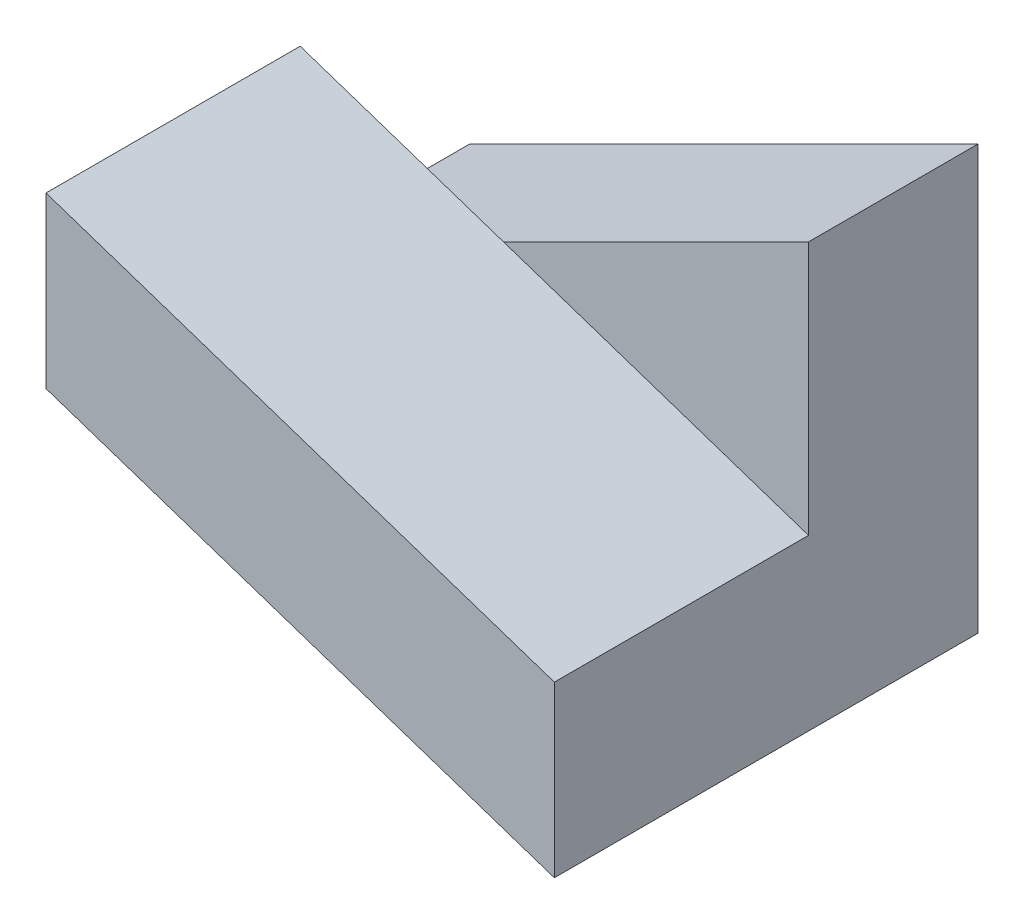
ISO-10303-21;
HEADER;
FILE_DESCRIPTION(('STEP AP214'),'2;1');
FILE_NAME('part.step','',(''),(''),'','','');
FILE_SCHEMA(('AUTOMOTIVE_DESIGN { 1 0 10303 214 1 1 1 1 }'));
ENDSEC;
DATA;
#1=APPLICATION_CONTEXT('core data for automotive mechanical design processes');
#2=APPLICATION_PROTOCOL_DEFINITION('international standard','automotive_design',2000,#1);
#3=PRODUCT_CONTEXT('',#1,'mechanical');
#4=PRODUCT('Part','Part','',(#3));
#5=PRODUCT_RELATED_PRODUCT_CATEGORY('part','',(#4));
#6=PRODUCT_DEFINITION_FORMATION('','',#4);
#7=PRODUCT_DEFINITION_CONTEXT('part definition',#1,'design');
#8=PRODUCT_DEFINITION('design','',#6,#7);
#9=PRODUCT_DEFINITION_SHAPE('','',#8);
#10=(LENGTH_UNIT() NAMED_UNIT(*) SI_UNIT(.MILLI.,.METRE.));
#11=(NAMED_UNIT(*) PLANE_ANGLE_UNIT() SI_UNIT($,.RADIAN.));
#12=(NAMED_UNIT(*) SI_UNIT($,.STERADIAN.) SOLID_ANGLE_UNIT());
#13=UNCERTAINTY_MEASURE_WITH_UNIT(LENGTH_MEASURE(1.E-05),#10,'distance_accuracy_value','');
#14=(GEOMETRIC_REPRESENTATION_CONTEXT(3) GLOBAL_UNCERTAINTY_ASSIGNED_CONTEXT((#13)) GLOBAL_UNIT_ASSIGNED_CONTEXT((#10,
#11,#12)) REPRESENTATION_CONTEXT('',''));
#15=CARTESIAN_POINT('',(0.,0.,0.));
#16=DIRECTION('',(0.,0.,1.));
#17=DIRECTION('',(1.,0.,0.));
#18=AXIS2_PLACEMENT_3D('',#15,#16,#17);
#19=CARTESIAN_POINT('',(0.,0.,10.));
#20=DIRECTION('',(0.,0.,-1.));
#21=DIRECTION('',(-1.,0.,0.));
#22=AXIS2_PLACEMENT_3D('',#19,#20,#21);
#23=PLANE('',#22);
#24=DIRECTION('',(0.948683298050514,-0.316227766016838,0.));
#25=VECTOR('',#24,1.);
#26=CARTESIAN_POINT('',(-30.,10.,10.));
#27=LINE('',#26,#25);
#28=CARTESIAN_POINT('',(-30.,10.,10.));
#29=VERTEX_POINT('',#28);
#30=CARTESIAN_POINT('',(0.,0.,10.));
#31=VERTEX_POINT('',#30);
#32=EDGE_CURVE('E123',#29,#31,#27,.T.);
#33=ORIENTED_EDGE('',*,*,#32,.F.);
#34=DIRECTION('',(0.,-1.,0.));
#35=VECTOR('',#34,1.);
#36=CARTESIAN_POINT('',(-30.,0.,10.));
#37=LINE('',#36,#35);
#38=CARTESIAN_POINT('',(-30.,0.,10.));
#39=VERTEX_POINT('',#38);
#40=EDGE_CURVE('E153',#29,#39,#37,.T.);
#41=ORIENTED_EDGE('',*,*,#40,.T.);
#42=DIRECTION('',(1.,0.,0.));
#43=VECTOR('',#42,1.);
#44=CARTESIAN_POINT('',(0.,0.,10.));
#45=LINE('',#44,#43);
#46=EDGE_CURVE('E59',#39,#31,#45,.T.);
#47=ORIENTED_EDGE('',*,*,#46,.T.);
#48=EDGE_LOOP('',(#33,#41,#47));
#49=FACE_BOUND('',#48,.T.);
#50=ADVANCED_FACE('F33',(#49),#23,.F.);
#51=DIRECTION('',(-0.948683298050514,0.316227766016838,0.));
#52=VECTOR('',#51,1.);
#53=CARTESIAN_POINT('',(-30.,20.,10.));
#54=LINE('',#53,#52);
#55=CARTESIAN_POINT('',(0.,10.,10.));
#56=VERTEX_POINT('',#55);
#57=CARTESIAN_POINT('',(-18.,16.,10.));
#58=VERTEX_POINT('',#57);
#59=EDGE_CURVE('E50',#56,#58,#54,.T.);
#60=ORIENTED_EDGE('',*,*,#59,.F.);
#61=DIRECTION('',(0.,1.,0.));
#62=VECTOR('',#61,1.);
#63=CARTESIAN_POINT('',(0.,25.,10.));
#64=LINE('',#63,#62);
#65=CARTESIAN_POINT('',(0.,25.,10.));
#66=VERTEX_POINT('',#65);
#67=EDGE_CURVE('E83',#56,#66,#64,.T.);
#68=ORIENTED_EDGE('',*,*,#67,.T.);
#69=DIRECTION('',(-0.894427190999916,-0.447213595499958,0.));
#70=VECTOR('',#69,1.);
#71=CARTESIAN_POINT('',(-30.,10.,10.));
#72=LINE('',#71,#70);
#73=EDGE_CURVE('E151',#66,#58,#72,.T.);
#74=ORIENTED_EDGE('',*,*,#73,.T.);
#75=EDGE_LOOP('',(#60,#68,#74));
#76=FACE_BOUND('',#75,.T.);
#77=ADVANCED_FACE('F183',(#76),#23,.F.);
#78=CARTESIAN_POINT('',(0.,25.,10.));
#79=DIRECTION('',(-1.,0.,0.));
#80=DIRECTION('',(0.,0.,1.));
#81=AXIS2_PLACEMENT_3D('',#78,#79,#80);
#82=PLANE('',#81);
#83=DIRECTION('',(0.,1.,0.));
#84=VECTOR('',#83,1.);
#85=CARTESIAN_POINT('',(0.,25.,0.));
#86=LINE('',#85,#84);
#87=CARTESIAN_POINT('',(0.,0.,0.));
#88=VERTEX_POINT('',#87);
#89=CARTESIAN_POINT('',(0.,25.,0.));
#90=VERTEX_POINT('',#89);
#91=EDGE_CURVE('E127',#88,#90,#86,.T.);
#92=ORIENTED_EDGE('',*,*,#91,.T.);
#93=DIRECTION('',(0.,0.,-1.));
#94=VECTOR('',#93,1.);
#95=CARTESIAN_POINT('',(0.,25.,10.));
#96=LINE('',#95,#94);
#97=EDGE_CURVE('E11',#66,#90,#96,.T.);
#98=ORIENTED_EDGE('',*,*,#97,.F.);
#99=ORIENTED_EDGE('',*,*,#67,.F.);
#100=DIRECTION('',(0.,0.,-1.));
#101=VECTOR('',#100,1.);
#102=CARTESIAN_POINT('',(0.,10.,25.));
#103=LINE('',#102,#101);
#104=CARTESIAN_POINT('',(0.,10.,25.));
#105=VERTEX_POINT('',#104);
#106=EDGE_CURVE('E108',#105,#56,#103,.T.);
#107=ORIENTED_EDGE('',*,*,#106,.F.);
#108=DIRECTION('',(0.,1.,0.));
#109=VECTOR('',#108,1.);
#110=CARTESIAN_POINT('',(0.,0.,25.));
#111=LINE('',#110,#109);
#112=CARTESIAN_POINT('',(0.,0.,25.));
#113=VERTEX_POINT('',#112);
#114=EDGE_CURVE('E114',#113,#105,#111,.T.);
#115=ORIENTED_EDGE('',*,*,#114,.F.);
#116=DIRECTION('',(0.,0.,-1.));
#117=VECTOR('',#116,1.);
#118=CARTESIAN_POINT('',(0.,0.,25.));
#119=LINE('',#118,#117);
#120=EDGE_CURVE('E146',#113,#31,#119,.T.);
#121=ORIENTED_EDGE('',*,*,#120,.T.);
#122=DIRECTION('',(0.,0.,-1.));
#123=VECTOR('',#122,1.);
#124=CARTESIAN_POINT('',(0.,0.,10.));
#125=LINE('',#124,#123);
#126=EDGE_CURVE('E156',#31,#88,#125,.T.);
#127=ORIENTED_EDGE('',*,*,#126,.T.);
#128=EDGE_LOOP('',(#92,#98,#99,#107,#115,#121,#127));
#129=FACE_BOUND('',#128,.T.);
#130=ADVANCED_FACE('F35',(#129),#82,.F.);
#131=CARTESIAN_POINT('',(-30.,10.,10.));
#132=DIRECTION('',(0.447213595499958,-0.894427190999916,0.));
#133=DIRECTION('',(0.894427190999916,0.447213595499958,0.));
#134=AXIS2_PLACEMENT_3D('',#131,#132,#133);
#135=PLANE('',#134);
#136=DIRECTION('',(-0.894427190999916,-0.447213595499958,0.));
#137=VECTOR('',#136,1.);
#138=CARTESIAN_POINT('',(-30.,10.,0.));
#139=LINE('',#138,#137);
#140=CARTESIAN_POINT('',(-30.,10.,0.));
#141=VERTEX_POINT('',#140);
#142=EDGE_CURVE('E128',#90,#141,#139,.T.);
#143=ORIENTED_EDGE('',*,*,#142,.T.);
#144=DIRECTION('',(0.,0.,-1.));
#145=VECTOR('',#144,1.);
#146=CARTESIAN_POINT('',(-30.,10.,10.));
#147=LINE('',#146,#145);
#148=EDGE_CURVE('E42',#29,#141,#147,.T.);
#149=ORIENTED_EDGE('',*,*,#148,.F.);
#150=EDGE_CURVE('E154',#58,#29,#72,.T.);
#151=ORIENTED_EDGE('',*,*,#150,.F.);
#152=ORIENTED_EDGE('',*,*,#73,.F.);
#153=ORIENTED_EDGE('',*,*,#97,.T.);
#154=EDGE_LOOP('',(#143,#149,#151,#152,#153));
#155=FACE_BOUND('',#154,.T.);
#156=ADVANCED_FACE('F196',(#155),#135,.F.);
#157=CARTESIAN_POINT('',(-30.,0.,10.));
#158=DIRECTION('',(1.,0.,0.));
#159=DIRECTION('',(0.,0.,-1.));
#160=AXIS2_PLACEMENT_3D('',#157,#158,#159);
#161=PLANE('',#160);
#162=DIRECTION('',(0.,-1.,0.));
#163=VECTOR('',#162,1.);
#164=CARTESIAN_POINT('',(-30.,0.,0.));
#165=LINE('',#164,#163);
#166=CARTESIAN_POINT('',(-30.,0.,0.));
#167=VERTEX_POINT('',#166);
#168=EDGE_CURVE('E159',#141,#167,#165,.T.);
#169=ORIENTED_EDGE('',*,*,#168,.T.);
#170=DIRECTION('',(0.,0.,-1.));
#171=VECTOR('',#170,1.);
#172=CARTESIAN_POINT('',(-30.,0.,10.));
#173=LINE('',#172,#171);
#174=EDGE_CURVE('E163',#39,#167,#173,.T.);
#175=ORIENTED_EDGE('',*,*,#174,.F.);
#176=ORIENTED_EDGE('',*,*,#40,.F.);
#177=ORIENTED_EDGE('',*,*,#148,.T.);
#178=EDGE_LOOP('',(#169,#175,#176,#177));
#179=FACE_BOUND('',#178,.T.);
#180=ADVANCED_FACE('F170',(#179),#161,.F.);
#181=CARTESIAN_POINT('',(0.,0.,10.));
#182=DIRECTION('',(0.,1.,0.));
#183=DIRECTION('',(-1.,0.,0.));
#184=AXIS2_PLACEMENT_3D('',#181,#182,#183);
#185=PLANE('',#184);
#186=DIRECTION('',(1.,0.,0.));
#187=VECTOR('',#186,1.);
#188=CARTESIAN_POINT('',(0.,0.,0.));
#189=LINE('',#188,#187);
#190=EDGE_CURVE('E80',#167,#88,#189,.T.);
#191=ORIENTED_EDGE('',*,*,#190,.T.);
#192=ORIENTED_EDGE('',*,*,#126,.F.);
#193=ORIENTED_EDGE('',*,*,#46,.F.);
#194=ORIENTED_EDGE('',*,*,#174,.T.);
#195=EDGE_LOOP('',(#191,#192,#193,#194));
#196=FACE_BOUND('',#195,.T.);
#197=ADVANCED_FACE('F178',(#196),#185,.F.);
#198=CARTESIAN_POINT('',(0.,0.,0.));
#199=DIRECTION('',(0.,0.,-1.));
#200=DIRECTION('',(-1.,0.,0.));
#201=AXIS2_PLACEMENT_3D('',#198,#199,#200);
#202=PLANE('',#201);
#203=ORIENTED_EDGE('',*,*,#91,.F.);
#204=ORIENTED_EDGE('',*,*,#190,.F.);
#205=ORIENTED_EDGE('',*,*,#168,.F.);
#206=ORIENTED_EDGE('',*,*,#142,.F.);
#207=EDGE_LOOP('',(#203,#204,#205,#206));
#208=FACE_BOUND('',#207,.T.);
#209=ADVANCED_FACE('F177',(#208),#202,.T.);
#210=CARTESIAN_POINT('',(-30.,20.,25.));
#211=DIRECTION('',(-0.316227766016838,-0.948683298050514,0.));
#212=DIRECTION('',(0.948683298050514,-0.316227766016838,0.));
#213=AXIS2_PLACEMENT_3D('',#210,#211,#212);
#214=PLANE('',#213);
#215=ORIENTED_EDGE('',*,*,#59,.T.);
#216=CARTESIAN_POINT('',(-30.,20.,10.));
#217=VERTEX_POINT('',#216);
#218=EDGE_CURVE('E136',#58,#217,#54,.T.);
#219=ORIENTED_EDGE('',*,*,#218,.T.);
#220=DIRECTION('',(0.,0.,-1.));
#221=VECTOR('',#220,1.);
#222=CARTESIAN_POINT('',(-30.,20.,25.));
#223=LINE('',#222,#221);
#224=CARTESIAN_POINT('',(-30.,20.,25.));
#225=VERTEX_POINT('',#224);
#226=EDGE_CURVE('E110',#225,#217,#223,.T.);
#227=ORIENTED_EDGE('',*,*,#226,.F.);
#228=DIRECTION('',(-0.948683298050514,0.316227766016838,0.));
#229=VECTOR('',#228,1.);
#230=CARTESIAN_POINT('',(-30.,20.,25.));
#231=LINE('',#230,#229);
#232=EDGE_CURVE('E104',#105,#225,#231,.T.);
#233=ORIENTED_EDGE('',*,*,#232,.F.);
#234=ORIENTED_EDGE('',*,*,#106,.T.);
#235=EDGE_LOOP('',(#215,#219,#227,#233,#234));
#236=FACE_BOUND('',#235,.T.);
#237=ADVANCED_FACE('F106',(#236),#214,.F.);
#238=CARTESIAN_POINT('',(-30.,10.,25.));
#239=DIRECTION('',(1.,0.,0.));
#240=DIRECTION('',(0.,0.,-1.));
#241=AXIS2_PLACEMENT_3D('',#238,#239,#240);
#242=PLANE('',#241);
#243=DIRECTION('',(0.,-1.,0.));
#244=VECTOR('',#243,1.);
#245=CARTESIAN_POINT('',(-30.,10.,10.));
#246=LINE('',#245,#244);
#247=EDGE_CURVE('E135',#217,#29,#246,.T.);
#248=ORIENTED_EDGE('',*,*,#247,.T.);
#249=DIRECTION('',(0.,0.,-1.));
#250=VECTOR('',#249,1.);
#251=CARTESIAN_POINT('',(-30.,10.,25.));
#252=LINE('',#251,#250);
#253=CARTESIAN_POINT('',(-30.,10.,25.));
#254=VERTEX_POINT('',#253);
#255=EDGE_CURVE('E130',#254,#29,#252,.T.);
#256=ORIENTED_EDGE('',*,*,#255,.F.);
#257=DIRECTION('',(0.,-1.,0.));
#258=VECTOR('',#257,1.);
#259=CARTESIAN_POINT('',(-30.,10.,25.));
#260=LINE('',#259,#258);
#261=EDGE_CURVE('E113',#225,#254,#260,.T.);
#262=ORIENTED_EDGE('',*,*,#261,.F.);
#263=ORIENTED_EDGE('',*,*,#226,.T.);
#264=EDGE_LOOP('',(#248,#256,#262,#263));
#265=FACE_BOUND('',#264,.T.);
#266=ADVANCED_FACE('F206',(#265),#242,.F.);
#267=CARTESIAN_POINT('',(-30.,10.,25.));
#268=DIRECTION('',(0.316227766016838,0.948683298050514,0.));
#269=DIRECTION('',(-0.948683298050514,0.316227766016838,0.));
#270=AXIS2_PLACEMENT_3D('',#267,#268,#269);
#271=PLANE('',#270);
#272=ORIENTED_EDGE('',*,*,#32,.T.);
#273=ORIENTED_EDGE('',*,*,#120,.F.);
#274=DIRECTION('',(0.948683298050514,-0.316227766016838,0.));
#275=VECTOR('',#274,1.);
#276=CARTESIAN_POINT('',(-30.,10.,25.));
#277=LINE('',#276,#275);
#278=EDGE_CURVE('E119',#254,#113,#277,.T.);
#279=ORIENTED_EDGE('',*,*,#278,.F.);
#280=ORIENTED_EDGE('',*,*,#255,.T.);
#281=EDGE_LOOP('',(#272,#273,#279,#280));
#282=FACE_BOUND('',#281,.T.);
#283=ADVANCED_FACE('F180',(#282),#271,.F.);
#284=CARTESIAN_POINT('',(0.,0.,25.));
#285=DIRECTION('',(0.,0.,-1.));
#286=DIRECTION('',(-1.,0.,0.));
#287=AXIS2_PLACEMENT_3D('',#284,#285,#286);
#288=PLANE('',#287);
#289=ORIENTED_EDGE('',*,*,#114,.T.);
#290=ORIENTED_EDGE('',*,*,#232,.T.);
#291=ORIENTED_EDGE('',*,*,#261,.T.);
#292=ORIENTED_EDGE('',*,*,#278,.T.);
#293=EDGE_LOOP('',(#289,#290,#291,#292));
#294=FACE_BOUND('',#293,.T.);
#295=ADVANCED_FACE('F117',(#294),#288,.F.);
#296=CARTESIAN_POINT('',(0.,0.,10.));
#297=DIRECTION('',(0.,0.,-1.));
#298=DIRECTION('',(-1.,0.,0.));
#299=AXIS2_PLACEMENT_3D('',#296,#297,#298);
#300=PLANE('',#299);
#301=ORIENTED_EDGE('',*,*,#218,.F.);
#302=ORIENTED_EDGE('',*,*,#150,.T.);
#303=ORIENTED_EDGE('',*,*,#247,.F.);
#304=EDGE_LOOP('',(#301,#302,#303));
#305=FACE_BOUND('',#304,.T.);
#306=ADVANCED_FACE('F204',(#305),#300,.T.);
#307=CLOSED_SHELL('',(#50,#77,#130,#156,#180,#197,#209,#237,#266,#283,#295,#306));
#308=MANIFOLD_SOLID_BREP('B2',#307);
#309=ADVANCED_BREP_SHAPE_REPRESENTATION('',(#18,#308),#14);
#310=SHAPE_DEFINITION_REPRESENTATION(#9,#309);
ENDSEC;
END-ISO-10303-21;
